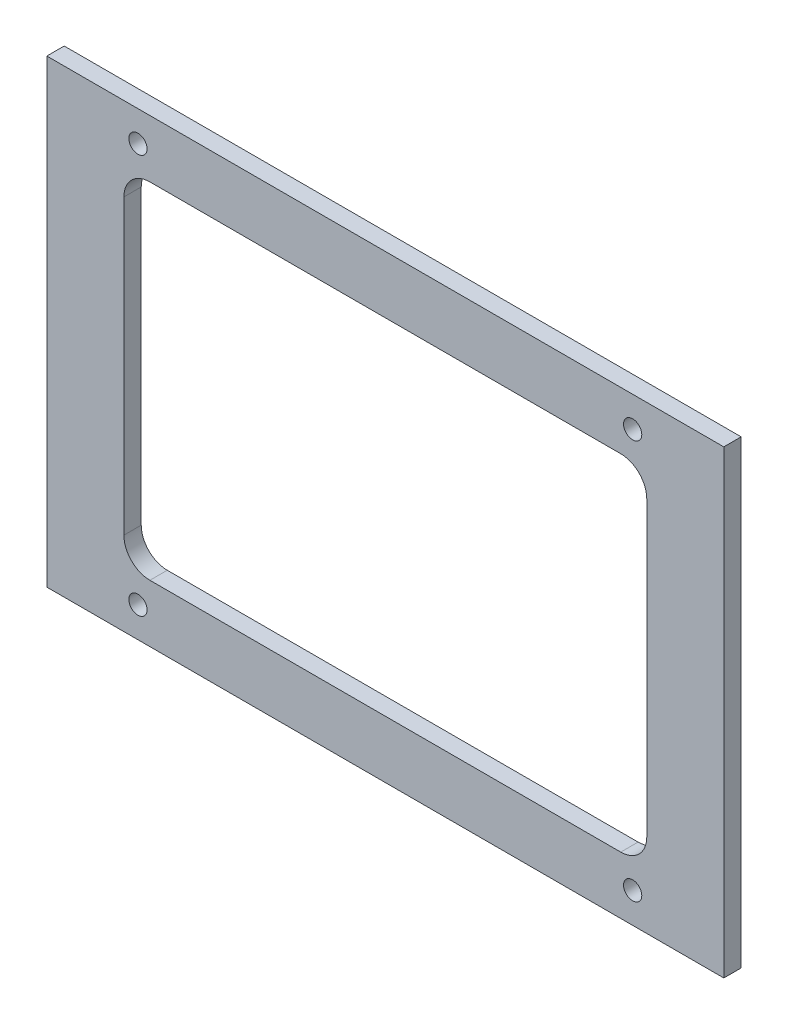
ISO-10303-21;
HEADER;
FILE_DESCRIPTION(('STEP AP214'),'2;1');
FILE_NAME('part.step','',(''),(''),'','','');
FILE_SCHEMA(('AUTOMOTIVE_DESIGN { 1 0 10303 214 1 1 1 1 }'));
ENDSEC;
DATA;
#1=APPLICATION_CONTEXT('core data for automotive mechanical design processes');
#2=APPLICATION_PROTOCOL_DEFINITION('international standard','automotive_design',2000,#1);
#3=PRODUCT_CONTEXT('',#1,'mechanical');
#4=PRODUCT('Part','Part','',(#3));
#5=PRODUCT_RELATED_PRODUCT_CATEGORY('part','',(#4));
#6=PRODUCT_DEFINITION_FORMATION('','',#4);
#7=PRODUCT_DEFINITION_CONTEXT('part definition',#1,'design');
#8=PRODUCT_DEFINITION('design','',#6,#7);
#9=PRODUCT_DEFINITION_SHAPE('','',#8);
#10=(LENGTH_UNIT() NAMED_UNIT(*) SI_UNIT(.MILLI.,.METRE.));
#11=(NAMED_UNIT(*) PLANE_ANGLE_UNIT() SI_UNIT($,.RADIAN.));
#12=(NAMED_UNIT(*) SI_UNIT($,.STERADIAN.) SOLID_ANGLE_UNIT());
#13=UNCERTAINTY_MEASURE_WITH_UNIT(LENGTH_MEASURE(1.E-05),#10,'distance_accuracy_value','');
#14=(GEOMETRIC_REPRESENTATION_CONTEXT(3) GLOBAL_UNCERTAINTY_ASSIGNED_CONTEXT((#13)) GLOBAL_UNIT_ASSIGNED_CONTEXT((#10,
#11,#12)) REPRESENTATION_CONTEXT('',''));
#15=CARTESIAN_POINT('',(0.,0.,0.));
#16=DIRECTION('',(0.,0.,1.));
#17=DIRECTION('',(1.,0.,0.));
#18=AXIS2_PLACEMENT_3D('',#15,#16,#17);
#19=CARTESIAN_POINT('',(0.,0.,-4.));
#20=DIRECTION('',(0.,0.,1.));
#21=DIRECTION('',(1.,0.,0.));
#22=AXIS2_PLACEMENT_3D('',#19,#20,#21);
#23=PLANE('',#22);
#24=CARTESIAN_POINT('',(57.,-46.,-4.));
#25=DIRECTION('',(0.,0.,1.));
#26=DIRECTION('',(1.,0.,0.));
#27=AXIS2_PLACEMENT_3D('',#24,#25,#26);
#28=CIRCLE('',#27,2.1);
#29=CARTESIAN_POINT('',(59.1,-46.,-4.));
#30=VERTEX_POINT('',#29);
#31=EDGE_CURVE('E313',#30,#30,#28,.F.);
#32=ORIENTED_EDGE('',*,*,#31,.F.);
#33=EDGE_LOOP('',(#32));
#34=FACE_BOUND('',#33,.T.);
#35=CARTESIAN_POINT('',(-57.,-46.,-4.));
#36=DIRECTION('',(0.,0.,1.));
#37=DIRECTION('',(1.,0.,0.));
#38=AXIS2_PLACEMENT_3D('',#35,#36,#37);
#39=CIRCLE('',#38,2.1);
#40=CARTESIAN_POINT('',(-54.9,-46.,-4.));
#41=VERTEX_POINT('',#40);
#42=EDGE_CURVE('E307',#41,#41,#39,.F.);
#43=ORIENTED_EDGE('',*,*,#42,.F.);
#44=EDGE_LOOP('',(#43));
#45=FACE_BOUND('',#44,.T.);
#46=CARTESIAN_POINT('',(-57.,46.,-4.));
#47=DIRECTION('',(0.,0.,1.));
#48=DIRECTION('',(1.,0.,0.));
#49=AXIS2_PLACEMENT_3D('',#46,#47,#48);
#50=CIRCLE('',#49,2.1);
#51=CARTESIAN_POINT('',(-54.9,46.,-4.));
#52=VERTEX_POINT('',#51);
#53=EDGE_CURVE('E301',#52,#52,#50,.F.);
#54=ORIENTED_EDGE('',*,*,#53,.F.);
#55=EDGE_LOOP('',(#54));
#56=FACE_BOUND('',#55,.T.);
#57=CARTESIAN_POINT('',(57.,46.,-4.));
#58=DIRECTION('',(0.,0.,1.));
#59=DIRECTION('',(1.,0.,0.));
#60=AXIS2_PLACEMENT_3D('',#57,#58,#59);
#61=CIRCLE('',#60,2.1);
#62=CARTESIAN_POINT('',(59.1,46.,-4.));
#63=VERTEX_POINT('',#62);
#64=EDGE_CURVE('E295',#63,#63,#61,.F.);
#65=ORIENTED_EDGE('',*,*,#64,.F.);
#66=EDGE_LOOP('',(#65));
#67=FACE_BOUND('',#66,.T.);
#68=DIRECTION('',(0.,1.,0.));
#69=VECTOR('',#68,1.);
#70=CARTESIAN_POINT('',(78.,53.,-4.));
#71=LINE('',#70,#69);
#72=CARTESIAN_POINT('',(78.,-53.,-4.));
#73=VERTEX_POINT('',#72);
#74=CARTESIAN_POINT('',(78.,53.,-4.));
#75=VERTEX_POINT('',#74);
#76=EDGE_CURVE('E183',#73,#75,#71,.T.);
#77=ORIENTED_EDGE('',*,*,#76,.F.);
#78=DIRECTION('',(1.,0.,0.));
#79=VECTOR('',#78,1.);
#80=CARTESIAN_POINT('',(-78.,-53.,-4.));
#81=LINE('',#80,#79);
#82=CARTESIAN_POINT('',(-78.,-53.,-4.));
#83=VERTEX_POINT('',#82);
#84=EDGE_CURVE('E193',#83,#73,#81,.T.);
#85=ORIENTED_EDGE('',*,*,#84,.F.);
#86=DIRECTION('',(0.,-1.,0.));
#87=VECTOR('',#86,1.);
#88=CARTESIAN_POINT('',(-78.,53.,-4.));
#89=LINE('',#88,#87);
#90=CARTESIAN_POINT('',(-78.,53.,-4.));
#91=VERTEX_POINT('',#90);
#92=EDGE_CURVE('E190',#91,#83,#89,.T.);
#93=ORIENTED_EDGE('',*,*,#92,.F.);
#94=DIRECTION('',(-1.,0.,0.));
#95=VECTOR('',#94,1.);
#96=CARTESIAN_POINT('',(-78.,53.,-4.));
#97=LINE('',#96,#95);
#98=EDGE_CURVE('E186',#75,#91,#97,.T.);
#99=ORIENTED_EDGE('',*,*,#98,.F.);
#100=EDGE_LOOP('',(#77,#85,#93,#99));
#101=FACE_BOUND('',#100,.T.);
#102=CARTESIAN_POINT('',(54.25,33.75,-4.));
#103=DIRECTION('',(0.,0.,1.));
#104=DIRECTION('',(1.,0.,0.));
#105=AXIS2_PLACEMENT_3D('',#102,#103,#104);
#106=CIRCLE('',#105,6.00000000000001);
#107=CARTESIAN_POINT('',(60.25,33.75,-4.));
#108=VERTEX_POINT('',#107);
#109=CARTESIAN_POINT('',(54.25,39.75,-4.));
#110=VERTEX_POINT('',#109);
#111=EDGE_CURVE('E139',#108,#110,#106,.T.);
#112=ORIENTED_EDGE('',*,*,#111,.T.);
#113=DIRECTION('',(-1.,0.,0.));
#114=VECTOR('',#113,1.);
#115=CARTESIAN_POINT('',(0.,39.75,-4.));
#116=LINE('',#115,#114);
#117=CARTESIAN_POINT('',(-54.25,39.75,-4.));
#118=VERTEX_POINT('',#117);
#119=EDGE_CURVE('E128',#110,#118,#116,.T.);
#120=ORIENTED_EDGE('',*,*,#119,.T.);
#121=CARTESIAN_POINT('',(-54.25,33.75,-4.));
#122=DIRECTION('',(0.,0.,1.));
#123=DIRECTION('',(1.,0.,0.));
#124=AXIS2_PLACEMENT_3D('',#121,#122,#123);
#125=CIRCLE('',#124,5.99999999999999);
#126=CARTESIAN_POINT('',(-60.25,33.75,-4.));
#127=VERTEX_POINT('',#126);
#128=EDGE_CURVE('E297',#127,#118,#125,.F.);
#129=ORIENTED_EDGE('',*,*,#128,.F.);
#130=DIRECTION('',(0.,1.,0.));
#131=VECTOR('',#130,1.);
#132=CARTESIAN_POINT('',(-60.25,0.,-4.));
#133=LINE('',#132,#131);
#134=CARTESIAN_POINT('',(-60.25,-33.75,-4.));
#135=VERTEX_POINT('',#134);
#136=EDGE_CURVE('E299',#135,#127,#133,.T.);
#137=ORIENTED_EDGE('',*,*,#136,.F.);
#138=CARTESIAN_POINT('',(-54.25,-33.75,-4.));
#139=DIRECTION('',(0.,0.,1.));
#140=DIRECTION('',(1.,0.,0.));
#141=AXIS2_PLACEMENT_3D('',#138,#139,#140);
#142=CIRCLE('',#141,5.99999999999999);
#143=CARTESIAN_POINT('',(-54.25,-39.75,-4.));
#144=VERTEX_POINT('',#143);
#145=EDGE_CURVE('E322',#144,#135,#142,.F.);
#146=ORIENTED_EDGE('',*,*,#145,.F.);
#147=DIRECTION('',(-1.,0.,0.));
#148=VECTOR('',#147,1.);
#149=CARTESIAN_POINT('',(0.,-39.75,-4.));
#150=LINE('',#149,#148);
#151=CARTESIAN_POINT('',(54.25,-39.75,-4.));
#152=VERTEX_POINT('',#151);
#153=EDGE_CURVE('E324',#152,#144,#150,.T.);
#154=ORIENTED_EDGE('',*,*,#153,.F.);
#155=CARTESIAN_POINT('',(54.25,-33.75,-4.));
#156=DIRECTION('',(0.,0.,1.));
#157=DIRECTION('',(1.,0.,0.));
#158=AXIS2_PLACEMENT_3D('',#155,#156,#157);
#159=CIRCLE('',#158,5.99999999999999);
#160=CARTESIAN_POINT('',(60.25,-33.75,-4.));
#161=VERTEX_POINT('',#160);
#162=EDGE_CURVE('E149',#161,#152,#159,.F.);
#163=ORIENTED_EDGE('',*,*,#162,.F.);
#164=DIRECTION('',(0.,1.,0.));
#165=VECTOR('',#164,1.);
#166=CARTESIAN_POINT('',(60.25,0.,-4.));
#167=LINE('',#166,#165);
#168=EDGE_CURVE('E145',#161,#108,#167,.T.);
#169=ORIENTED_EDGE('',*,*,#168,.T.);
#170=EDGE_LOOP('',(#112,#120,#129,#137,#146,#154,#163,#169));
#171=FACE_BOUND('',#170,.T.);
#172=ADVANCED_FACE('F39',(#34,#45,#56,#67,#101,#171),#23,.F.);
#173=CARTESIAN_POINT('',(0.,0.,0.));
#174=DIRECTION('',(0.,0.,1.));
#175=DIRECTION('',(1.,0.,0.));
#176=AXIS2_PLACEMENT_3D('',#173,#174,#175);
#177=PLANE('',#176);
#178=CARTESIAN_POINT('',(57.,-46.,0.));
#179=DIRECTION('',(0.,0.,1.));
#180=DIRECTION('',(1.,0.,0.));
#181=AXIS2_PLACEMENT_3D('',#178,#179,#180);
#182=CIRCLE('',#181,2.1);
#183=CARTESIAN_POINT('',(59.1,-46.,0.));
#184=VERTEX_POINT('',#183);
#185=EDGE_CURVE('E316',#184,#184,#182,.T.);
#186=ORIENTED_EDGE('',*,*,#185,.F.);
#187=EDGE_LOOP('',(#186));
#188=FACE_BOUND('',#187,.T.);
#189=CARTESIAN_POINT('',(-57.,-46.,0.));
#190=DIRECTION('',(0.,0.,1.));
#191=DIRECTION('',(1.,0.,0.));
#192=AXIS2_PLACEMENT_3D('',#189,#190,#191);
#193=CIRCLE('',#192,2.1);
#194=CARTESIAN_POINT('',(-54.9,-46.,0.));
#195=VERTEX_POINT('',#194);
#196=EDGE_CURVE('E310',#195,#195,#193,.T.);
#197=ORIENTED_EDGE('',*,*,#196,.F.);
#198=EDGE_LOOP('',(#197));
#199=FACE_BOUND('',#198,.T.);
#200=CARTESIAN_POINT('',(-57.,46.,0.));
#201=DIRECTION('',(0.,0.,1.));
#202=DIRECTION('',(1.,0.,0.));
#203=AXIS2_PLACEMENT_3D('',#200,#201,#202);
#204=CIRCLE('',#203,2.1);
#205=CARTESIAN_POINT('',(-54.9,46.,0.));
#206=VERTEX_POINT('',#205);
#207=EDGE_CURVE('E304',#206,#206,#204,.T.);
#208=ORIENTED_EDGE('',*,*,#207,.F.);
#209=EDGE_LOOP('',(#208));
#210=FACE_BOUND('',#209,.T.);
#211=CARTESIAN_POINT('',(57.,46.,0.));
#212=DIRECTION('',(0.,0.,1.));
#213=DIRECTION('',(1.,0.,0.));
#214=AXIS2_PLACEMENT_3D('',#211,#212,#213);
#215=CIRCLE('',#214,2.1);
#216=CARTESIAN_POINT('',(59.1,46.,0.));
#217=VERTEX_POINT('',#216);
#218=EDGE_CURVE('E292',#217,#217,#215,.T.);
#219=ORIENTED_EDGE('',*,*,#218,.F.);
#220=EDGE_LOOP('',(#219));
#221=FACE_BOUND('',#220,.T.);
#222=DIRECTION('',(0.,1.,0.));
#223=VECTOR('',#222,1.);
#224=CARTESIAN_POINT('',(78.,53.,0.));
#225=LINE('',#224,#223);
#226=CARTESIAN_POINT('',(78.,-53.,0.));
#227=VERTEX_POINT('',#226);
#228=CARTESIAN_POINT('',(78.,53.,0.));
#229=VERTEX_POINT('',#228);
#230=EDGE_CURVE('E135',#227,#229,#225,.T.);
#231=ORIENTED_EDGE('',*,*,#230,.T.);
#232=DIRECTION('',(-1.,0.,0.));
#233=VECTOR('',#232,1.);
#234=CARTESIAN_POINT('',(-78.,53.,0.));
#235=LINE('',#234,#233);
#236=CARTESIAN_POINT('',(-78.,53.,0.));
#237=VERTEX_POINT('',#236);
#238=EDGE_CURVE('E198',#229,#237,#235,.T.);
#239=ORIENTED_EDGE('',*,*,#238,.T.);
#240=DIRECTION('',(0.,-1.,0.));
#241=VECTOR('',#240,1.);
#242=CARTESIAN_POINT('',(-78.,53.,0.));
#243=LINE('',#242,#241);
#244=CARTESIAN_POINT('',(-78.,-53.,0.));
#245=VERTEX_POINT('',#244);
#246=EDGE_CURVE('E201',#237,#245,#243,.T.);
#247=ORIENTED_EDGE('',*,*,#246,.T.);
#248=DIRECTION('',(1.,0.,0.));
#249=VECTOR('',#248,1.);
#250=CARTESIAN_POINT('',(-78.,-53.,0.));
#251=LINE('',#250,#249);
#252=EDGE_CURVE('E187',#245,#227,#251,.T.);
#253=ORIENTED_EDGE('',*,*,#252,.T.);
#254=EDGE_LOOP('',(#231,#239,#247,#253));
#255=FACE_BOUND('',#254,.T.);
#256=DIRECTION('',(1.,0.,0.));
#257=VECTOR('',#256,1.);
#258=CARTESIAN_POINT('',(0.,39.75,0.));
#259=LINE('',#258,#257);
#260=CARTESIAN_POINT('',(-54.25,39.75,0.));
#261=VERTEX_POINT('',#260);
#262=CARTESIAN_POINT('',(54.25,39.75,0.));
#263=VERTEX_POINT('',#262);
#264=EDGE_CURVE('E147',#261,#263,#259,.T.);
#265=ORIENTED_EDGE('',*,*,#264,.T.);
#266=CARTESIAN_POINT('',(54.25,33.75,0.));
#267=DIRECTION('',(0.,0.,1.));
#268=DIRECTION('',(1.,0.,0.));
#269=AXIS2_PLACEMENT_3D('',#266,#267,#268);
#270=CIRCLE('',#269,6.00000000000001);
#271=CARTESIAN_POINT('',(60.25,33.75,0.));
#272=VERTEX_POINT('',#271);
#273=EDGE_CURVE('E64',#263,#272,#270,.F.);
#274=ORIENTED_EDGE('',*,*,#273,.T.);
#275=DIRECTION('',(0.,-1.,0.));
#276=VECTOR('',#275,1.);
#277=CARTESIAN_POINT('',(60.25,0.,0.));
#278=LINE('',#277,#276);
#279=CARTESIAN_POINT('',(60.25,-33.75,0.));
#280=VERTEX_POINT('',#279);
#281=EDGE_CURVE('E141',#272,#280,#278,.T.);
#282=ORIENTED_EDGE('',*,*,#281,.T.);
#283=CARTESIAN_POINT('',(54.25,-33.75,0.));
#284=DIRECTION('',(0.,0.,1.));
#285=DIRECTION('',(1.,0.,0.));
#286=AXIS2_PLACEMENT_3D('',#283,#284,#285);
#287=CIRCLE('',#286,5.99999999999999);
#288=CARTESIAN_POINT('',(54.25,-39.75,0.));
#289=VERTEX_POINT('',#288);
#290=EDGE_CURVE('E166',#289,#280,#287,.T.);
#291=ORIENTED_EDGE('',*,*,#290,.F.);
#292=DIRECTION('',(1.,0.,0.));
#293=VECTOR('',#292,1.);
#294=CARTESIAN_POINT('',(0.,-39.75,0.));
#295=LINE('',#294,#293);
#296=CARTESIAN_POINT('',(-54.25,-39.75,0.));
#297=VERTEX_POINT('',#296);
#298=EDGE_CURVE('E163',#297,#289,#295,.T.);
#299=ORIENTED_EDGE('',*,*,#298,.F.);
#300=CARTESIAN_POINT('',(-54.25,-33.75,0.));
#301=DIRECTION('',(0.,0.,1.));
#302=DIRECTION('',(1.,0.,0.));
#303=AXIS2_PLACEMENT_3D('',#300,#301,#302);
#304=CIRCLE('',#303,5.99999999999999);
#305=CARTESIAN_POINT('',(-60.25,-33.75,0.));
#306=VERTEX_POINT('',#305);
#307=EDGE_CURVE('E160',#306,#297,#304,.T.);
#308=ORIENTED_EDGE('',*,*,#307,.F.);
#309=DIRECTION('',(0.,-1.,0.));
#310=VECTOR('',#309,1.);
#311=CARTESIAN_POINT('',(-60.25,0.,0.));
#312=LINE('',#311,#310);
#313=CARTESIAN_POINT('',(-60.25,33.75,0.));
#314=VERTEX_POINT('',#313);
#315=EDGE_CURVE('E157',#314,#306,#312,.T.);
#316=ORIENTED_EDGE('',*,*,#315,.F.);
#317=CARTESIAN_POINT('',(-54.25,33.75,0.));
#318=DIRECTION('',(0.,0.,1.));
#319=DIRECTION('',(1.,0.,0.));
#320=AXIS2_PLACEMENT_3D('',#317,#318,#319);
#321=CIRCLE('',#320,5.99999999999999);
#322=EDGE_CURVE('E154',#261,#314,#321,.T.);
#323=ORIENTED_EDGE('',*,*,#322,.F.);
#324=EDGE_LOOP('',(#265,#274,#282,#291,#299,#308,#316,#323));
#325=FACE_BOUND('',#324,.T.);
#326=ADVANCED_FACE('F216',(#188,#199,#210,#221,#255,#325),#177,.T.);
#327=CARTESIAN_POINT('',(78.,53.,-4.));
#328=DIRECTION('',(1.,0.,0.));
#329=DIRECTION('',(0.,1.,0.));
#330=AXIS2_PLACEMENT_3D('',#327,#328,#329);
#331=PLANE('',#330);
#332=ORIENTED_EDGE('',*,*,#230,.F.);
#333=DIRECTION('',(0.,0.,1.));
#334=VECTOR('',#333,1.);
#335=CARTESIAN_POINT('',(78.,-53.,-4.));
#336=LINE('',#335,#334);
#337=EDGE_CURVE('E11',#73,#227,#336,.T.);
#338=ORIENTED_EDGE('',*,*,#337,.F.);
#339=ORIENTED_EDGE('',*,*,#76,.T.);
#340=DIRECTION('',(0.,0.,1.));
#341=VECTOR('',#340,1.);
#342=CARTESIAN_POINT('',(78.,53.,-4.));
#343=LINE('',#342,#341);
#344=EDGE_CURVE('E43',#75,#229,#343,.T.);
#345=ORIENTED_EDGE('',*,*,#344,.T.);
#346=EDGE_LOOP('',(#332,#338,#339,#345));
#347=FACE_BOUND('',#346,.T.);
#348=ADVANCED_FACE('F41',(#347),#331,.T.);
#349=CARTESIAN_POINT('',(-78.,-53.,-4.));
#350=DIRECTION('',(0.,-1.,0.));
#351=DIRECTION('',(0.,0.,-1.));
#352=AXIS2_PLACEMENT_3D('',#349,#350,#351);
#353=PLANE('',#352);
#354=ORIENTED_EDGE('',*,*,#252,.F.);
#355=DIRECTION('',(0.,0.,1.));
#356=VECTOR('',#355,1.);
#357=CARTESIAN_POINT('',(-78.,-53.,-4.));
#358=LINE('',#357,#356);
#359=EDGE_CURVE('E48',#83,#245,#358,.T.);
#360=ORIENTED_EDGE('',*,*,#359,.F.);
#361=ORIENTED_EDGE('',*,*,#84,.T.);
#362=ORIENTED_EDGE('',*,*,#337,.T.);
#363=EDGE_LOOP('',(#354,#360,#361,#362));
#364=FACE_BOUND('',#363,.T.);
#365=ADVANCED_FACE('F220',(#364),#353,.T.);
#366=CARTESIAN_POINT('',(-78.,53.,-4.));
#367=DIRECTION('',(-1.,0.,0.));
#368=DIRECTION('',(0.,0.,1.));
#369=AXIS2_PLACEMENT_3D('',#366,#367,#368);
#370=PLANE('',#369);
#371=ORIENTED_EDGE('',*,*,#246,.F.);
#372=DIRECTION('',(0.,0.,1.));
#373=VECTOR('',#372,1.);
#374=CARTESIAN_POINT('',(-78.,53.,-4.));
#375=LINE('',#374,#373);
#376=EDGE_CURVE('E206',#91,#237,#375,.T.);
#377=ORIENTED_EDGE('',*,*,#376,.F.);
#378=ORIENTED_EDGE('',*,*,#92,.T.);
#379=ORIENTED_EDGE('',*,*,#359,.T.);
#380=EDGE_LOOP('',(#371,#377,#378,#379));
#381=FACE_BOUND('',#380,.T.);
#382=ADVANCED_FACE('F225',(#381),#370,.T.);
#383=CARTESIAN_POINT('',(-78.,53.,-4.));
#384=DIRECTION('',(0.,1.,0.));
#385=DIRECTION('',(0.,0.,1.));
#386=AXIS2_PLACEMENT_3D('',#383,#384,#385);
#387=PLANE('',#386);
#388=ORIENTED_EDGE('',*,*,#238,.F.);
#389=ORIENTED_EDGE('',*,*,#344,.F.);
#390=ORIENTED_EDGE('',*,*,#98,.T.);
#391=ORIENTED_EDGE('',*,*,#376,.T.);
#392=EDGE_LOOP('',(#388,#389,#390,#391));
#393=FACE_BOUND('',#392,.T.);
#394=ADVANCED_FACE('F214',(#393),#387,.T.);
#395=CARTESIAN_POINT('',(54.25,33.75,-4.001));
#396=DIRECTION('',(0.,0.,1.));
#397=DIRECTION('',(1.,0.,0.));
#398=AXIS2_PLACEMENT_3D('',#395,#396,#397);
#399=CYLINDRICAL_SURFACE('',#398,6.00000000000001);
#400=DIRECTION('',(0.,0.,1.));
#401=VECTOR('',#400,1.);
#402=CARTESIAN_POINT('',(60.25,33.75,-4.001));
#403=LINE('',#402,#401);
#404=EDGE_CURVE('E136',#108,#272,#403,.T.);
#405=ORIENTED_EDGE('',*,*,#404,.T.);
#406=ORIENTED_EDGE('',*,*,#273,.F.);
#407=DIRECTION('',(0.,0.,1.));
#408=VECTOR('',#407,1.);
#409=CARTESIAN_POINT('',(54.25,39.75,-4.001));
#410=LINE('',#409,#408);
#411=EDGE_CURVE('E130',#110,#263,#410,.T.);
#412=ORIENTED_EDGE('',*,*,#411,.F.);
#413=ORIENTED_EDGE('',*,*,#111,.F.);
#414=EDGE_LOOP('',(#405,#406,#412,#413));
#415=FACE_BOUND('',#414,.T.);
#416=ADVANCED_FACE('F138',(#415),#399,.F.);
#417=CARTESIAN_POINT('',(60.25,0.,-4.001));
#418=DIRECTION('',(-1.,0.,0.));
#419=DIRECTION('',(0.,-1.,0.));
#420=AXIS2_PLACEMENT_3D('',#417,#418,#419);
#421=PLANE('',#420);
#422=DIRECTION('',(0.,0.,1.));
#423=VECTOR('',#422,1.);
#424=CARTESIAN_POINT('',(60.25,-33.75,-4.001));
#425=LINE('',#424,#423);
#426=EDGE_CURVE('E172',#161,#280,#425,.T.);
#427=ORIENTED_EDGE('',*,*,#426,.T.);
#428=ORIENTED_EDGE('',*,*,#281,.F.);
#429=ORIENTED_EDGE('',*,*,#404,.F.);
#430=ORIENTED_EDGE('',*,*,#168,.F.);
#431=EDGE_LOOP('',(#427,#428,#429,#430));
#432=FACE_BOUND('',#431,.T.);
#433=ADVANCED_FACE('F246',(#432),#421,.T.);
#434=CARTESIAN_POINT('',(54.25,-33.75,-4.001));
#435=DIRECTION('',(0.,0.,1.));
#436=DIRECTION('',(1.,0.,0.));
#437=AXIS2_PLACEMENT_3D('',#434,#435,#436);
#438=CYLINDRICAL_SURFACE('',#437,5.99999999999999);
#439=ORIENTED_EDGE('',*,*,#162,.T.);
#440=DIRECTION('',(0.,0.,1.));
#441=VECTOR('',#440,1.);
#442=CARTESIAN_POINT('',(54.25,-39.75,-4.001));
#443=LINE('',#442,#441);
#444=EDGE_CURVE('E174',#152,#289,#443,.T.);
#445=ORIENTED_EDGE('',*,*,#444,.T.);
#446=ORIENTED_EDGE('',*,*,#290,.T.);
#447=ORIENTED_EDGE('',*,*,#426,.F.);
#448=EDGE_LOOP('',(#439,#445,#446,#447));
#449=FACE_BOUND('',#448,.T.);
#450=ADVANCED_FACE('F265',(#449),#438,.F.);
#451=CARTESIAN_POINT('',(0.,-39.75,-4.001));
#452=DIRECTION('',(0.,-1.,0.));
#453=DIRECTION('',(0.,0.,-1.));
#454=AXIS2_PLACEMENT_3D('',#451,#452,#453);
#455=PLANE('',#454);
#456=ORIENTED_EDGE('',*,*,#153,.T.);
#457=DIRECTION('',(0.,0.,1.));
#458=VECTOR('',#457,1.);
#459=CARTESIAN_POINT('',(-54.25,-39.75,-4.001));
#460=LINE('',#459,#458);
#461=EDGE_CURVE('E176',#144,#297,#460,.T.);
#462=ORIENTED_EDGE('',*,*,#461,.T.);
#463=ORIENTED_EDGE('',*,*,#298,.T.);
#464=ORIENTED_EDGE('',*,*,#444,.F.);
#465=EDGE_LOOP('',(#456,#462,#463,#464));
#466=FACE_BOUND('',#465,.T.);
#467=ADVANCED_FACE('F261',(#466),#455,.F.);
#468=CARTESIAN_POINT('',(-54.25,-33.75,-4.001));
#469=DIRECTION('',(0.,0.,1.));
#470=DIRECTION('',(1.,0.,0.));
#471=AXIS2_PLACEMENT_3D('',#468,#469,#470);
#472=CYLINDRICAL_SURFACE('',#471,5.99999999999999);
#473=ORIENTED_EDGE('',*,*,#145,.T.);
#474=DIRECTION('',(0.,0.,1.));
#475=VECTOR('',#474,1.);
#476=CARTESIAN_POINT('',(-60.25,-33.75,-4.001));
#477=LINE('',#476,#475);
#478=EDGE_CURVE('E178',#135,#306,#477,.T.);
#479=ORIENTED_EDGE('',*,*,#478,.T.);
#480=ORIENTED_EDGE('',*,*,#307,.T.);
#481=ORIENTED_EDGE('',*,*,#461,.F.);
#482=EDGE_LOOP('',(#473,#479,#480,#481));
#483=FACE_BOUND('',#482,.T.);
#484=ADVANCED_FACE('F257',(#483),#472,.F.);
#485=CARTESIAN_POINT('',(-60.25,0.,-4.001));
#486=DIRECTION('',(-1.,0.,0.));
#487=DIRECTION('',(0.,-1.,0.));
#488=AXIS2_PLACEMENT_3D('',#485,#486,#487);
#489=PLANE('',#488);
#490=ORIENTED_EDGE('',*,*,#136,.T.);
#491=DIRECTION('',(0.,0.,1.));
#492=VECTOR('',#491,1.);
#493=CARTESIAN_POINT('',(-60.25,33.75,-4.001));
#494=LINE('',#493,#492);
#495=EDGE_CURVE('E180',#127,#314,#494,.T.);
#496=ORIENTED_EDGE('',*,*,#495,.T.);
#497=ORIENTED_EDGE('',*,*,#315,.T.);
#498=ORIENTED_EDGE('',*,*,#478,.F.);
#499=EDGE_LOOP('',(#490,#496,#497,#498));
#500=FACE_BOUND('',#499,.T.);
#501=ADVANCED_FACE('F253',(#500),#489,.F.);
#502=CARTESIAN_POINT('',(-54.25,33.75,-4.001));
#503=DIRECTION('',(0.,0.,1.));
#504=DIRECTION('',(1.,0.,0.));
#505=AXIS2_PLACEMENT_3D('',#502,#503,#504);
#506=CYLINDRICAL_SURFACE('',#505,5.99999999999999);
#507=ORIENTED_EDGE('',*,*,#128,.T.);
#508=DIRECTION('',(0.,0.,1.));
#509=VECTOR('',#508,1.);
#510=CARTESIAN_POINT('',(-54.25,39.75,-4.001));
#511=LINE('',#510,#509);
#512=EDGE_CURVE('E56',#118,#261,#511,.T.);
#513=ORIENTED_EDGE('',*,*,#512,.T.);
#514=ORIENTED_EDGE('',*,*,#322,.T.);
#515=ORIENTED_EDGE('',*,*,#495,.F.);
#516=EDGE_LOOP('',(#507,#513,#514,#515));
#517=FACE_BOUND('',#516,.T.);
#518=ADVANCED_FACE('F250',(#517),#506,.F.);
#519=CARTESIAN_POINT('',(0.,39.75,-4.001));
#520=DIRECTION('',(0.,-1.,0.));
#521=DIRECTION('',(0.,0.,-1.));
#522=AXIS2_PLACEMENT_3D('',#519,#520,#521);
#523=PLANE('',#522);
#524=ORIENTED_EDGE('',*,*,#411,.T.);
#525=ORIENTED_EDGE('',*,*,#264,.F.);
#526=ORIENTED_EDGE('',*,*,#512,.F.);
#527=ORIENTED_EDGE('',*,*,#119,.F.);
#528=EDGE_LOOP('',(#524,#525,#526,#527));
#529=FACE_BOUND('',#528,.T.);
#530=ADVANCED_FACE('F129',(#529),#523,.T.);
#531=CARTESIAN_POINT('',(57.,46.,-4.001));
#532=DIRECTION('',(0.,0.,1.));
#533=DIRECTION('',(1.,0.,0.));
#534=AXIS2_PLACEMENT_3D('',#531,#532,#533);
#535=CYLINDRICAL_SURFACE('',#534,2.1);
#536=ORIENTED_EDGE('',*,*,#218,.T.);
#537=EDGE_LOOP('',(#536));
#538=FACE_BOUND('',#537,.T.);
#539=ORIENTED_EDGE('',*,*,#64,.T.);
#540=EDGE_LOOP('',(#539));
#541=FACE_BOUND('',#540,.T.);
#542=ADVANCED_FACE('F249',(#538,#541),#535,.F.);
#543=CARTESIAN_POINT('',(-57.,46.,-4.001));
#544=DIRECTION('',(0.,0.,1.));
#545=DIRECTION('',(1.,0.,0.));
#546=AXIS2_PLACEMENT_3D('',#543,#544,#545);
#547=CYLINDRICAL_SURFACE('',#546,2.1);
#548=ORIENTED_EDGE('',*,*,#207,.T.);
#549=EDGE_LOOP('',(#548));
#550=FACE_BOUND('',#549,.T.);
#551=ORIENTED_EDGE('',*,*,#53,.T.);
#552=EDGE_LOOP('',(#551));
#553=FACE_BOUND('',#552,.T.);
#554=ADVANCED_FACE('F280',(#550,#553),#547,.F.);
#555=CARTESIAN_POINT('',(-57.,-46.,-4.001));
#556=DIRECTION('',(0.,0.,1.));
#557=DIRECTION('',(1.,0.,0.));
#558=AXIS2_PLACEMENT_3D('',#555,#556,#557);
#559=CYLINDRICAL_SURFACE('',#558,2.1);
#560=ORIENTED_EDGE('',*,*,#196,.T.);
#561=EDGE_LOOP('',(#560));
#562=FACE_BOUND('',#561,.T.);
#563=ORIENTED_EDGE('',*,*,#42,.T.);
#564=EDGE_LOOP('',(#563));
#565=FACE_BOUND('',#564,.T.);
#566=ADVANCED_FACE('F276',(#562,#565),#559,.F.);
#567=CARTESIAN_POINT('',(57.,-46.,-4.001));
#568=DIRECTION('',(0.,0.,1.));
#569=DIRECTION('',(1.,0.,0.));
#570=AXIS2_PLACEMENT_3D('',#567,#568,#569);
#571=CYLINDRICAL_SURFACE('',#570,2.1);
#572=ORIENTED_EDGE('',*,*,#185,.T.);
#573=EDGE_LOOP('',(#572));
#574=FACE_BOUND('',#573,.T.);
#575=ORIENTED_EDGE('',*,*,#31,.T.);
#576=EDGE_LOOP('',(#575));
#577=FACE_BOUND('',#576,.T.);
#578=ADVANCED_FACE('F273',(#574,#577),#571,.F.);
#579=CLOSED_SHELL('',(#172,#326,#348,#365,#382,#394,#416,#433,#450,#467,#484,#501,#518,#530,
#542,#554,#566,#578));
#580=MANIFOLD_SOLID_BREP('B2',#579);
#581=ADVANCED_BREP_SHAPE_REPRESENTATION('',(#18,#580),#14);
#582=SHAPE_DEFINITION_REPRESENTATION(#9,#581);
ENDSEC;
END-ISO-10303-21;
